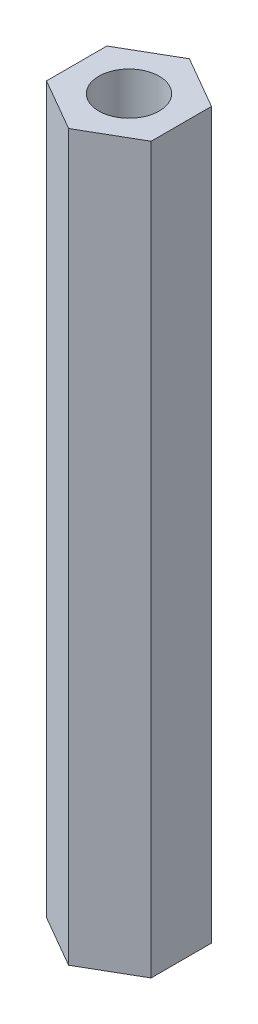
ISO-10303-21;
HEADER;
FILE_DESCRIPTION(('STEP AP214'),'2;1');
FILE_NAME('part.step','',(''),(''),'','','');
FILE_SCHEMA(('AUTOMOTIVE_DESIGN { 1 0 10303 214 1 1 1 1 }'));
ENDSEC;
DATA;
#1=APPLICATION_CONTEXT('core data for automotive mechanical design processes');
#2=APPLICATION_PROTOCOL_DEFINITION('international standard','automotive_design',2000,#1);
#3=PRODUCT_CONTEXT('',#1,'mechanical');
#4=PRODUCT('Part','Part','',(#3));
#5=PRODUCT_RELATED_PRODUCT_CATEGORY('part','',(#4));
#6=PRODUCT_DEFINITION_FORMATION('','',#4);
#7=PRODUCT_DEFINITION_CONTEXT('part definition',#1,'design');
#8=PRODUCT_DEFINITION('design','',#6,#7);
#9=PRODUCT_DEFINITION_SHAPE('','',#8);
#10=(LENGTH_UNIT() NAMED_UNIT(*) SI_UNIT(.MILLI.,.METRE.));
#11=(NAMED_UNIT(*) PLANE_ANGLE_UNIT() SI_UNIT($,.RADIAN.));
#12=(NAMED_UNIT(*) SI_UNIT($,.STERADIAN.) SOLID_ANGLE_UNIT());
#13=UNCERTAINTY_MEASURE_WITH_UNIT(LENGTH_MEASURE(1.E-05),#10,'distance_accuracy_value','');
#14=(GEOMETRIC_REPRESENTATION_CONTEXT(3) GLOBAL_UNCERTAINTY_ASSIGNED_CONTEXT((#13)) GLOBAL_UNIT_ASSIGNED_CONTEXT((#10,
#11,#12)) REPRESENTATION_CONTEXT('',''));
#15=CARTESIAN_POINT('',(0.,0.,0.));
#16=DIRECTION('',(0.,0.,1.));
#17=DIRECTION('',(1.,0.,0.));
#18=AXIS2_PLACEMENT_3D('',#15,#16,#17);
#19=CARTESIAN_POINT('',(0.,60.,-5.));
#20=DIRECTION('',(0.,1.,0.));
#21=DIRECTION('',(0.,0.,1.));
#22=AXIS2_PLACEMENT_3D('',#19,#20,#21);
#23=PLANE('',#22);
#24=DIRECTION('',(-0.866025403784439,0.,-0.5));
#25=VECTOR('',#24,1.);
#26=CARTESIAN_POINT('',(4.33012701892219,60.,-2.5));
#27=LINE('',#26,#25);
#28=CARTESIAN_POINT('',(4.33012701892219,60.,-2.5));
#29=VERTEX_POINT('',#28);
#30=CARTESIAN_POINT('',(0.,60.,-5.));
#31=VERTEX_POINT('',#30);
#32=EDGE_CURVE('E129',#29,#31,#27,.T.);
#33=ORIENTED_EDGE('',*,*,#32,.T.);
#34=DIRECTION('',(-0.866025403784439,0.,0.5));
#35=VECTOR('',#34,1.);
#36=CARTESIAN_POINT('',(0.,60.,-5.));
#37=LINE('',#36,#35);
#38=CARTESIAN_POINT('',(-4.33012701892219,60.,-2.5));
#39=VERTEX_POINT('',#38);
#40=EDGE_CURVE('E87',#31,#39,#37,.T.);
#41=ORIENTED_EDGE('',*,*,#40,.T.);
#42=DIRECTION('',(0.,0.,1.));
#43=VECTOR('',#42,1.);
#44=CARTESIAN_POINT('',(-4.33012701892219,60.,-2.5));
#45=LINE('',#44,#43);
#46=CARTESIAN_POINT('',(-4.33012701892219,60.,2.5));
#47=VERTEX_POINT('',#46);
#48=EDGE_CURVE('E100',#39,#47,#45,.T.);
#49=ORIENTED_EDGE('',*,*,#48,.T.);
#50=DIRECTION('',(0.866025403784439,0.,0.5));
#51=VECTOR('',#50,1.);
#52=CARTESIAN_POINT('',(-4.33012701892219,60.,2.5));
#53=LINE('',#52,#51);
#54=CARTESIAN_POINT('',(0.,60.,5.));
#55=VERTEX_POINT('',#54);
#56=EDGE_CURVE('E94',#47,#55,#53,.T.);
#57=ORIENTED_EDGE('',*,*,#56,.T.);
#58=DIRECTION('',(0.866025403784439,0.,-0.5));
#59=VECTOR('',#58,1.);
#60=CARTESIAN_POINT('',(0.,60.,5.));
#61=LINE('',#60,#59);
#62=CARTESIAN_POINT('',(4.33012701892219,60.,2.5));
#63=VERTEX_POINT('',#62);
#64=EDGE_CURVE('E98',#55,#63,#61,.T.);
#65=ORIENTED_EDGE('',*,*,#64,.T.);
#66=DIRECTION('',(0.,0.,-1.));
#67=VECTOR('',#66,1.);
#68=CARTESIAN_POINT('',(4.33012701892219,60.,2.5));
#69=LINE('',#68,#67);
#70=EDGE_CURVE('E50',#63,#29,#69,.T.);
#71=ORIENTED_EDGE('',*,*,#70,.T.);
#72=EDGE_LOOP('',(#33,#41,#49,#57,#65,#71));
#73=FACE_BOUND('',#72,.T.);
#74=CARTESIAN_POINT('',(0.,60.,0.));
#75=DIRECTION('',(0.,1.,0.));
#76=DIRECTION('',(0.,0.,1.));
#77=AXIS2_PLACEMENT_3D('',#74,#75,#76);
#78=CIRCLE('',#77,2.5);
#79=CARTESIAN_POINT('',(0.,60.,2.5));
#80=VERTEX_POINT('',#79);
#81=EDGE_CURVE('E122',#80,#80,#78,.T.);
#82=ORIENTED_EDGE('',*,*,#81,.F.);
#83=EDGE_LOOP('',(#82));
#84=FACE_BOUND('',#83,.T.);
#85=ADVANCED_FACE('F33',(#73,#84),#23,.T.);
#86=CARTESIAN_POINT('',(0.,0.,-5.));
#87=DIRECTION('',(0.,1.,0.));
#88=DIRECTION('',(0.,0.,1.));
#89=AXIS2_PLACEMENT_3D('',#86,#87,#88);
#90=PLANE('',#89);
#91=DIRECTION('',(-0.866025403784439,0.,-0.5));
#92=VECTOR('',#91,1.);
#93=CARTESIAN_POINT('',(4.33012701892219,0.,-2.5));
#94=LINE('',#93,#92);
#95=CARTESIAN_POINT('',(4.33012701892219,0.,-2.5));
#96=VERTEX_POINT('',#95);
#97=CARTESIAN_POINT('',(0.,0.,-5.));
#98=VERTEX_POINT('',#97);
#99=EDGE_CURVE('E118',#96,#98,#94,.T.);
#100=ORIENTED_EDGE('',*,*,#99,.F.);
#101=DIRECTION('',(0.,0.,-1.));
#102=VECTOR('',#101,1.);
#103=CARTESIAN_POINT('',(4.33012701892219,0.,2.5));
#104=LINE('',#103,#102);
#105=CARTESIAN_POINT('',(4.33012701892219,0.,2.5));
#106=VERTEX_POINT('',#105);
#107=EDGE_CURVE('E79',#106,#96,#104,.T.);
#108=ORIENTED_EDGE('',*,*,#107,.F.);
#109=DIRECTION('',(0.866025403784439,0.,-0.5));
#110=VECTOR('',#109,1.);
#111=CARTESIAN_POINT('',(0.,0.,5.));
#112=LINE('',#111,#110);
#113=CARTESIAN_POINT('',(0.,0.,5.));
#114=VERTEX_POINT('',#113);
#115=EDGE_CURVE('E73',#114,#106,#112,.T.);
#116=ORIENTED_EDGE('',*,*,#115,.F.);
#117=DIRECTION('',(0.866025403784439,0.,0.5));
#118=VECTOR('',#117,1.);
#119=CARTESIAN_POINT('',(-4.33012701892219,0.,2.5));
#120=LINE('',#119,#118);
#121=CARTESIAN_POINT('',(-4.33012701892219,0.,2.5));
#122=VERTEX_POINT('',#121);
#123=EDGE_CURVE('E108',#122,#114,#120,.T.);
#124=ORIENTED_EDGE('',*,*,#123,.F.);
#125=DIRECTION('',(0.,0.,1.));
#126=VECTOR('',#125,1.);
#127=CARTESIAN_POINT('',(-4.33012701892219,0.,-2.5));
#128=LINE('',#127,#126);
#129=CARTESIAN_POINT('',(-4.33012701892219,0.,-2.5));
#130=VERTEX_POINT('',#129);
#131=EDGE_CURVE('E124',#130,#122,#128,.T.);
#132=ORIENTED_EDGE('',*,*,#131,.F.);
#133=DIRECTION('',(-0.866025403784439,0.,0.5));
#134=VECTOR('',#133,1.);
#135=CARTESIAN_POINT('',(0.,0.,-5.));
#136=LINE('',#135,#134);
#137=EDGE_CURVE('E121',#98,#130,#136,.T.);
#138=ORIENTED_EDGE('',*,*,#137,.F.);
#139=EDGE_LOOP('',(#100,#108,#116,#124,#132,#138));
#140=FACE_BOUND('',#139,.T.);
#141=CARTESIAN_POINT('',(0.,0.,0.));
#142=DIRECTION('',(0.,1.,0.));
#143=DIRECTION('',(0.,0.,1.));
#144=AXIS2_PLACEMENT_3D('',#141,#142,#143);
#145=CIRCLE('',#144,2.5);
#146=CARTESIAN_POINT('',(0.,0.,2.5));
#147=VERTEX_POINT('',#146);
#148=EDGE_CURVE('E222',#147,#147,#145,.T.);
#149=ORIENTED_EDGE('',*,*,#148,.T.);
#150=EDGE_LOOP('',(#149));
#151=FACE_BOUND('',#150,.T.);
#152=ADVANCED_FACE('F138',(#140,#151),#90,.F.);
#153=CARTESIAN_POINT('',(4.33012701892219,60.,-2.5));
#154=DIRECTION('',(-0.5,0.,0.866025403784439));
#155=DIRECTION('',(0.866025403784439,0.,0.5));
#156=AXIS2_PLACEMENT_3D('',#153,#154,#155);
#157=PLANE('',#156);
#158=ORIENTED_EDGE('',*,*,#99,.T.);
#159=DIRECTION('',(0.,-1.,0.));
#160=VECTOR('',#159,1.);
#161=CARTESIAN_POINT('',(0.,60.,-5.));
#162=LINE('',#161,#160);
#163=EDGE_CURVE('E11',#31,#98,#162,.T.);
#164=ORIENTED_EDGE('',*,*,#163,.F.);
#165=ORIENTED_EDGE('',*,*,#32,.F.);
#166=DIRECTION('',(0.,-1.,0.));
#167=VECTOR('',#166,1.);
#168=CARTESIAN_POINT('',(4.33012701892219,60.,-2.5));
#169=LINE('',#168,#167);
#170=EDGE_CURVE('E114',#29,#96,#169,.T.);
#171=ORIENTED_EDGE('',*,*,#170,.T.);
#172=EDGE_LOOP('',(#158,#164,#165,#171));
#173=FACE_BOUND('',#172,.T.);
#174=ADVANCED_FACE('F35',(#173),#157,.F.);
#175=CARTESIAN_POINT('',(0.,60.,-5.));
#176=DIRECTION('',(0.5,0.,0.866025403784439));
#177=DIRECTION('',(0.866025403784439,0.,-0.5));
#178=AXIS2_PLACEMENT_3D('',#175,#176,#177);
#179=PLANE('',#178);
#180=ORIENTED_EDGE('',*,*,#137,.T.);
#181=DIRECTION('',(0.,-1.,0.));
#182=VECTOR('',#181,1.);
#183=CARTESIAN_POINT('',(-4.33012701892219,60.,-2.5));
#184=LINE('',#183,#182);
#185=EDGE_CURVE('E42',#39,#130,#184,.T.);
#186=ORIENTED_EDGE('',*,*,#185,.F.);
#187=ORIENTED_EDGE('',*,*,#40,.F.);
#188=ORIENTED_EDGE('',*,*,#163,.T.);
#189=EDGE_LOOP('',(#180,#186,#187,#188));
#190=FACE_BOUND('',#189,.T.);
#191=ADVANCED_FACE('F163',(#190),#179,.F.);
#192=CARTESIAN_POINT('',(-4.33012701892219,60.,-2.5));
#193=DIRECTION('',(1.,0.,0.));
#194=DIRECTION('',(0.,0.,-1.));
#195=AXIS2_PLACEMENT_3D('',#192,#193,#194);
#196=PLANE('',#195);
#197=ORIENTED_EDGE('',*,*,#131,.T.);
#198=DIRECTION('',(0.,-1.,0.));
#199=VECTOR('',#198,1.);
#200=CARTESIAN_POINT('',(-4.33012701892219,60.,2.5));
#201=LINE('',#200,#199);
#202=EDGE_CURVE('E109',#47,#122,#201,.T.);
#203=ORIENTED_EDGE('',*,*,#202,.F.);
#204=ORIENTED_EDGE('',*,*,#48,.F.);
#205=ORIENTED_EDGE('',*,*,#185,.T.);
#206=EDGE_LOOP('',(#197,#203,#204,#205));
#207=FACE_BOUND('',#206,.T.);
#208=ADVANCED_FACE('F135',(#207),#196,.F.);
#209=CARTESIAN_POINT('',(-4.33012701892219,60.,2.5));
#210=DIRECTION('',(0.5,0.,-0.866025403784439));
#211=DIRECTION('',(-0.866025403784439,0.,-0.5));
#212=AXIS2_PLACEMENT_3D('',#209,#210,#211);
#213=PLANE('',#212);
#214=ORIENTED_EDGE('',*,*,#123,.T.);
#215=DIRECTION('',(0.,-1.,0.));
#216=VECTOR('',#215,1.);
#217=CARTESIAN_POINT('',(0.,60.,5.));
#218=LINE('',#217,#216);
#219=EDGE_CURVE('E105',#55,#114,#218,.T.);
#220=ORIENTED_EDGE('',*,*,#219,.F.);
#221=ORIENTED_EDGE('',*,*,#56,.F.);
#222=ORIENTED_EDGE('',*,*,#202,.T.);
#223=EDGE_LOOP('',(#214,#220,#221,#222));
#224=FACE_BOUND('',#223,.T.);
#225=ADVANCED_FACE('F106',(#224),#213,.F.);
#226=CARTESIAN_POINT('',(0.,60.,5.));
#227=DIRECTION('',(-0.5,0.,-0.866025403784439));
#228=DIRECTION('',(-0.866025403784439,0.,0.5));
#229=AXIS2_PLACEMENT_3D('',#226,#227,#228);
#230=PLANE('',#229);
#231=ORIENTED_EDGE('',*,*,#115,.T.);
#232=DIRECTION('',(0.,-1.,0.));
#233=VECTOR('',#232,1.);
#234=CARTESIAN_POINT('',(4.33012701892219,60.,2.5));
#235=LINE('',#234,#233);
#236=EDGE_CURVE('E110',#63,#106,#235,.T.);
#237=ORIENTED_EDGE('',*,*,#236,.F.);
#238=ORIENTED_EDGE('',*,*,#64,.F.);
#239=ORIENTED_EDGE('',*,*,#219,.T.);
#240=EDGE_LOOP('',(#231,#237,#238,#239));
#241=FACE_BOUND('',#240,.T.);
#242=ADVANCED_FACE('F112',(#241),#230,.F.);
#243=CARTESIAN_POINT('',(4.33012701892219,60.,2.5));
#244=DIRECTION('',(-1.,0.,0.));
#245=DIRECTION('',(0.,0.,1.));
#246=AXIS2_PLACEMENT_3D('',#243,#244,#245);
#247=PLANE('',#246);
#248=ORIENTED_EDGE('',*,*,#107,.T.);
#249=ORIENTED_EDGE('',*,*,#170,.F.);
#250=ORIENTED_EDGE('',*,*,#70,.F.);
#251=ORIENTED_EDGE('',*,*,#236,.T.);
#252=EDGE_LOOP('',(#248,#249,#250,#251));
#253=FACE_BOUND('',#252,.T.);
#254=ADVANCED_FACE('F143',(#253),#247,.F.);
#255=CARTESIAN_POINT('',(0.,60.,0.));
#256=DIRECTION('',(0.,-1.,0.));
#257=DIRECTION('',(0.,0.,-1.));
#258=AXIS2_PLACEMENT_3D('',#255,#256,#257);
#259=CYLINDRICAL_SURFACE('',#258,2.5);
#260=ORIENTED_EDGE('',*,*,#81,.T.);
#261=EDGE_LOOP('',(#260));
#262=FACE_BOUND('',#261,.T.);
#263=ORIENTED_EDGE('',*,*,#148,.F.);
#264=EDGE_LOOP('',(#263));
#265=FACE_BOUND('',#264,.T.);
#266=ADVANCED_FACE('F145',(#262,#265),#259,.F.);
#267=CLOSED_SHELL('',(#85,#152,#174,#191,#208,#225,#242,#254,#266));
#268=MANIFOLD_SOLID_BREP('B2',#267);
#269=ADVANCED_BREP_SHAPE_REPRESENTATION('',(#18,#268),#14);
#270=SHAPE_DEFINITION_REPRESENTATION(#9,#269);
ENDSEC;
END-ISO-10303-21;
